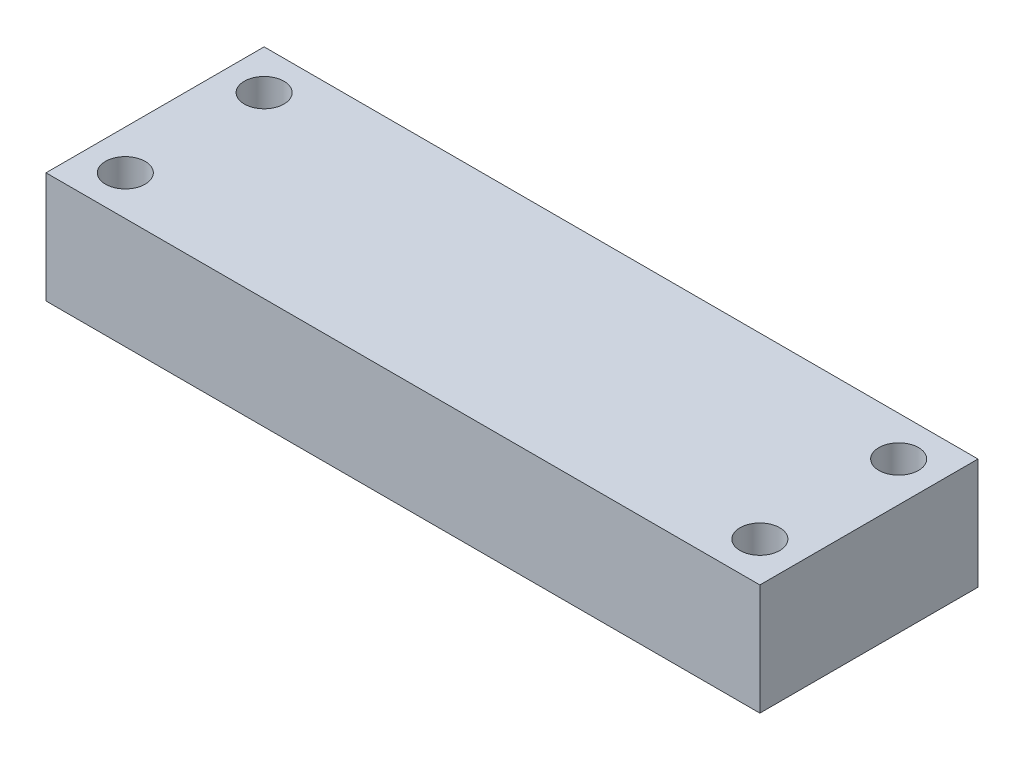
ISO-10303-21;
HEADER;
FILE_DESCRIPTION(('STEP AP214'),'2;1');
FILE_NAME('part.step','',(''),(''),'','','');
FILE_SCHEMA(('AUTOMOTIVE_DESIGN { 1 0 10303 214 1 1 1 1 }'));
ENDSEC;
DATA;
#1=APPLICATION_CONTEXT('core data for automotive mechanical design processes');
#2=APPLICATION_PROTOCOL_DEFINITION('international standard','automotive_design',2000,#1);
#3=PRODUCT_CONTEXT('',#1,'mechanical');
#4=PRODUCT('Part','Part','',(#3));
#5=PRODUCT_RELATED_PRODUCT_CATEGORY('part','',(#4));
#6=PRODUCT_DEFINITION_FORMATION('','',#4);
#7=PRODUCT_DEFINITION_CONTEXT('part definition',#1,'design');
#8=PRODUCT_DEFINITION('design','',#6,#7);
#9=PRODUCT_DEFINITION_SHAPE('','',#8);
#10=(LENGTH_UNIT() NAMED_UNIT(*) SI_UNIT(.MILLI.,.METRE.));
#11=(NAMED_UNIT(*) PLANE_ANGLE_UNIT() SI_UNIT($,.RADIAN.));
#12=(NAMED_UNIT(*) SI_UNIT($,.STERADIAN.) SOLID_ANGLE_UNIT());
#13=UNCERTAINTY_MEASURE_WITH_UNIT(LENGTH_MEASURE(1.E-05),#10,'distance_accuracy_value','');
#14=(GEOMETRIC_REPRESENTATION_CONTEXT(3) GLOBAL_UNCERTAINTY_ASSIGNED_CONTEXT((#13)) GLOBAL_UNIT_ASSIGNED_CONTEXT((#10,
#11,#12)) REPRESENTATION_CONTEXT('',''));
#15=CARTESIAN_POINT('',(0.,0.,0.));
#16=DIRECTION('',(0.,0.,1.));
#17=DIRECTION('',(1.,0.,0.));
#18=AXIS2_PLACEMENT_3D('',#15,#16,#17);
#19=CARTESIAN_POINT('',(0.,263.525,0.));
#20=DIRECTION('',(0.,1.,0.));
#21=DIRECTION('',(0.,0.,1.));
#22=AXIS2_PLACEMENT_3D('',#19,#20,#21);
#23=PLANE('',#22);
#24=CARTESIAN_POINT('',(70.0000000000001,263.525,10.));
#25=DIRECTION('',(0.,1.,0.));
#26=DIRECTION('',(0.,0.,1.));
#27=AXIS2_PLACEMENT_3D('',#24,#25,#26);
#28=CIRCLE('',#27,3.175);
#29=CARTESIAN_POINT('',(70.0000000000001,263.525,13.175));
#30=VERTEX_POINT('',#29);
#31=EDGE_CURVE('E38',#30,#30,#28,.T.);
#32=ORIENTED_EDGE('',*,*,#31,.T.);
#33=EDGE_LOOP('',(#32));
#34=FACE_BOUND('',#33,.T.);
#35=CARTESIAN_POINT('',(70.0000000000001,263.525,45.));
#36=DIRECTION('',(0.,1.,0.));
#37=DIRECTION('',(0.,0.,1.));
#38=AXIS2_PLACEMENT_3D('',#35,#36,#37);
#39=CIRCLE('',#38,3.175);
#40=CARTESIAN_POINT('',(70.0000000000001,263.525,48.175));
#41=VERTEX_POINT('',#40);
#42=EDGE_CURVE('E126',#41,#41,#39,.T.);
#43=ORIENTED_EDGE('',*,*,#42,.T.);
#44=EDGE_LOOP('',(#43));
#45=FACE_BOUND('',#44,.T.);
#46=CARTESIAN_POINT('',(230.,263.525,45.));
#47=DIRECTION('',(0.,1.,0.));
#48=DIRECTION('',(0.,0.,1.));
#49=AXIS2_PLACEMENT_3D('',#46,#47,#48);
#50=CIRCLE('',#49,3.175);
#51=CARTESIAN_POINT('',(230.,263.525,48.175));
#52=VERTEX_POINT('',#51);
#53=EDGE_CURVE('E123',#52,#52,#50,.T.);
#54=ORIENTED_EDGE('',*,*,#53,.T.);
#55=EDGE_LOOP('',(#54));
#56=FACE_BOUND('',#55,.T.);
#57=CARTESIAN_POINT('',(230.,263.525,9.99999999999999));
#58=DIRECTION('',(0.,1.,0.));
#59=DIRECTION('',(0.,0.,1.));
#60=AXIS2_PLACEMENT_3D('',#57,#58,#59);
#61=CIRCLE('',#60,3.175);
#62=CARTESIAN_POINT('',(230.,263.525,13.175));
#63=VERTEX_POINT('',#62);
#64=EDGE_CURVE('E120',#63,#63,#61,.T.);
#65=ORIENTED_EDGE('',*,*,#64,.T.);
#66=EDGE_LOOP('',(#65));
#67=FACE_BOUND('',#66,.T.);
#68=DIRECTION('',(1.,0.,0.));
#69=VECTOR('',#68,1.);
#70=CARTESIAN_POINT('',(241.253264434507,263.525,0.));
#71=LINE('',#70,#69);
#72=CARTESIAN_POINT('',(60.,263.525,0.));
#73=VERTEX_POINT('',#72);
#74=CARTESIAN_POINT('',(107.564012782426,263.525,0.));
#75=VERTEX_POINT('',#74);
#76=EDGE_CURVE('E110',#73,#75,#71,.T.);
#77=ORIENTED_EDGE('',*,*,#76,.T.);
#78=DIRECTION('',(0.,0.,1.));
#79=VECTOR('',#78,1.);
#80=CARTESIAN_POINT('',(107.564012782432,263.525,200.400182821008));
#81=LINE('',#80,#79);
#82=CARTESIAN_POINT('',(107.564012782429,263.525000000001,33.0000000025199));
#83=VERTEX_POINT('',#82);
#84=EDGE_CURVE('E50',#83,#75,#81,.F.);
#85=ORIENTED_EDGE('',*,*,#84,.F.);
#86=CARTESIAN_POINT('',(128.409183393374,263.525,37.2754741948868));
#87=CARTESIAN_POINT('',(128.051894710239,263.525,37.2836641761605));
#88=CARTESIAN_POINT('',(127.6945808691,263.525,37.2908580436216));
#89=CARTESIAN_POINT('',(126.979800252876,263.525,37.3029213767301));
#90=CARTESIAN_POINT('',(126.622333465375,263.525,37.3077900998672));
#91=CARTESIAN_POINT('',(125.907308636066,263.525,37.3148659469851));
#92=CARTESIAN_POINT('',(125.549750589352,263.525,37.3170725961095));
#93=CARTESIAN_POINT('',(124.834606252839,263.525,37.3184574758383));
#94=CARTESIAN_POINT('',(124.477019962629,263.525,37.3176355252875));
#95=CARTESIAN_POINT('',(123.760859504184,263.525,37.3125603889058));
#96=CARTESIAN_POINT('',(123.402285400806,263.525,37.3082975102587));
#97=CARTESIAN_POINT('',(122.685229894357,263.525,37.2958901570463));
#98=CARTESIAN_POINT('',(122.326748486316,263.525,37.2877459769455));
#99=CARTESIAN_POINT('',(121.60994018102,263.525,37.2670886446054));
#100=CARTESIAN_POINT('',(121.251613273173,263.525,37.2545758660324));
#101=CARTESIAN_POINT('',(120.53517713601,263.525,37.2246302296394));
#102=CARTESIAN_POINT('',(120.177067898286,263.525,37.2071975758378));
#103=CARTESIAN_POINT('',(119.472458511016,263.525,37.1674163274857));
#104=CARTESIAN_POINT('',(119.125948714547,263.525,37.1452402692858));
#105=CARTESIAN_POINT('',(118.433337233113,263.525,37.0950078689188));
#106=CARTESIAN_POINT('',(118.087235565238,263.525,37.0669512887018));
#107=CARTESIAN_POINT('',(117.39558596318,263.525,37.0041603520604));
#108=CARTESIAN_POINT('',(117.050038109821,263.525,36.9694250971018));
#109=CARTESIAN_POINT('',(116.359590004402,263.525,36.8922968555982));
#110=CARTESIAN_POINT('',(116.014690234281,263.525,36.8498995114988));
#111=CARTESIAN_POINT('',(115.326116320868,263.525,36.7562713772811));
#112=CARTESIAN_POINT('',(114.982442058973,263.525,36.7050414670269));
#113=CARTESIAN_POINT('',(114.296852999469,263.525,36.5922400283021));
#114=CARTESIAN_POINT('',(113.954937812492,263.525,36.5306708997104));
#115=CARTESIAN_POINT('',(113.342578387325,263.525,36.4088892849372));
#116=CARTESIAN_POINT('',(113.071688159953,263.525,36.350928985456));
#117=CARTESIAN_POINT('',(112.531986217608,263.525,36.2257654929522));
#118=CARTESIAN_POINT('',(112.263174825383,263.525,36.1585608939787));
#119=CARTESIAN_POINT('',(111.729479500192,263.525,36.0133604224585));
#120=CARTESIAN_POINT('',(111.464584999961,263.525,35.9354037755901));
#121=CARTESIAN_POINT('',(110.939177098807,263.525,35.7660655485733));
#122=CARTESIAN_POINT('',(110.678661894095,263.525,35.6746896545641));
#123=CARTESIAN_POINT('',(110.223056142982,263.525,35.4977009565297));
#124=CARTESIAN_POINT('',(110.026636970608,263.525,35.4155548510646));
#125=CARTESIAN_POINT('',(109.735818493693,263.525,35.2826000075541));
#126=CARTESIAN_POINT('',(109.639255498186,263.525,35.2365197732933));
#127=CARTESIAN_POINT('',(109.447949554132,263.525,35.1407358617284));
#128=CARTESIAN_POINT('',(109.35320641394,263.525,35.091032568634));
#129=CARTESIAN_POINT('',(109.138333573493,263.525,34.9722147119986));
#130=CARTESIAN_POINT('',(109.018968390922,263.525,34.9017020260968));
#131=CARTESIAN_POINT('',(108.785349757699,263.525,34.7522949595584));
#132=CARTESIAN_POINT('',(108.671101925771,263.525,34.6733916720582));
#133=CARTESIAN_POINT('',(108.450989762533,263.525,34.506097782546));
#134=CARTESIAN_POINT('',(108.345070978818,263.525,34.4177796013186));
#135=CARTESIAN_POINT('',(108.144622993734,263.525,34.2291331654217));
#136=CARTESIAN_POINT('',(108.050062419983,263.525,34.1288395928631));
#137=CARTESIAN_POINT('',(107.935041881477,263.525,33.9848109789745));
#138=CARTESIAN_POINT('',(107.906759946686,263.525,33.9472762981489));
#139=CARTESIAN_POINT('',(107.852620597751,263.525,33.8704851403311));
#140=CARTESIAN_POINT('',(107.826763127543,263.525,33.8312287031852));
#141=CARTESIAN_POINT('',(107.777981826993,263.525,33.7511543108066));
#142=CARTESIAN_POINT('',(107.755045988739,263.525,33.7103437059798));
#143=CARTESIAN_POINT('',(107.712426164581,263.525,33.6270452176555));
#144=CARTESIAN_POINT('',(107.692742285601,263.525,33.584557279064));
#145=CARTESIAN_POINT('',(107.657416466249,263.525,33.4987945123038));
#146=CARTESIAN_POINT('',(107.641709629132,263.525,33.4555465963542));
#147=CARTESIAN_POINT('',(107.61433987614,263.525,33.367798178957));
#148=CARTESIAN_POINT('',(107.602675383712,263.525,33.3232981731746));
#149=CARTESIAN_POINT('',(107.583625199713,263.525,33.2326422484606));
#150=CARTESIAN_POINT('',(107.576310440143,263.525,33.1864712531426));
#151=CARTESIAN_POINT('',(107.566483790554,263.525,33.093540588437));
#152=CARTESIAN_POINT('',(107.563980524835,263.525,33.0467800129328));
#153=CARTESIAN_POINT('',(107.564012782427,263.525,33.0000000025199));
#154=B_SPLINE_CURVE_WITH_KNOTS('',3,(#86,#87,#88,#89,#90,#91,#92,#93,#94,#95,#96,#97,#98,#99,
#100,#101,#102,#103,#104,#105,#106,#107,#108,#109,#110,#111,#112,#113,#114,#115,#116,#117,#118,
#119,#120,#121,#122,#123,#124,#125,#126,#127,#128,#129,#130,#131,#132,#133,#134,#135,#136,#137,
#138,#139,#140,#141,#142,#143,#144,#145,#146,#147,#148,#149,#150,#151,#152,#153),.UNSPECIFIED.,
.F.,.F.,(4,2,2,2,2,2,2,2,2,2,2,2,2,2,2,2,2,2,2,2,2,2,2,2,2,2,2,2,2,2,2,2,2,4),(0.,
1.07214969800926,2.14464154708534,3.21732467720169,4.29007197070426,5.36585169632604,
6.44154981826362,7.51715595332175,8.59271749148728,9.63432970381734,10.6759840898922,
11.7177787160515,12.7601677029906,13.802452911334,14.8444965240809,15.6754296450747,
16.5064892813857,17.3345935148826,18.1623478627303,18.8006703086957,19.1215899108674,
19.4424755302602,19.8581120492394,20.2741942678702,20.6872798417487,21.0991968367766,
21.2401141352356,21.3810281741905,21.5213429653124,21.6616623690712,21.799518187145,
21.9373201794314,22.0773117464936,22.2175540064837),.UNSPECIFIED.);
#155=CARTESIAN_POINT('',(128.409183393374,263.525,37.2754741948869));
#156=VERTEX_POINT('',#155);
#157=EDGE_CURVE('E57',#156,#83,#154,.T.);
#158=ORIENTED_EDGE('',*,*,#157,.F.);
#159=CARTESIAN_POINT('',(128.409183393375,263.525,37.2754741948869));
#160=CARTESIAN_POINT('',(128.935315344216,263.525,37.2634224363284));
#161=CARTESIAN_POINT('',(129.461491505504,263.525,37.2535435033356));
#162=CARTESIAN_POINT('',(130.513852839061,263.525,37.237426466283));
#163=CARTESIAN_POINT('',(131.040038006218,263.525,37.2311880332933));
#164=CARTESIAN_POINT('',(132.092412602007,263.525,37.2216454362855));
#165=CARTESIAN_POINT('',(132.61860202968,263.525,37.2183411582906));
#166=CARTESIAN_POINT('',(133.670985228738,263.525,37.2140483026083));
#167=CARTESIAN_POINT('',(134.19717900005,263.525,37.2130597054449));
#168=CARTESIAN_POINT('',(135.249572115499,263.525,37.2128345851069));
#169=CARTESIAN_POINT('',(135.775771459634,263.525,37.2135980813797));
#170=CARTESIAN_POINT('',(136.828173533466,263.525,37.2163711429077));
#171=CARTESIAN_POINT('',(137.354376263115,263.525,37.2183807248162));
#172=CARTESIAN_POINT('',(138.406783389086,263.525,37.2231925593134));
#173=CARTESIAN_POINT('',(138.932987785367,263.525,37.2259948201963));
#174=CARTESIAN_POINT('',(139.985396245271,263.525,37.2319931499325));
#175=CARTESIAN_POINT('',(140.511600308883,263.525,37.2351892202885));
#176=CARTESIAN_POINT('',(141.886491043867,263.525,37.2435928187358));
#177=CARTESIAN_POINT('',(142.735177525047,263.525,37.2488326767238));
#178=CARTESIAN_POINT('',(144.432556553816,263.525,37.2582425022373));
#179=CARTESIAN_POINT('',(145.281249101403,263.525,37.2624124701066));
#180=CARTESIAN_POINT('',(146.978632631595,263.525,37.2688930427409));
#181=CARTESIAN_POINT('',(147.827323614121,263.525,37.2712036674703));
#182=CARTESIAN_POINT('',(149.52470899831,263.525,37.2735609607826));
#183=CARTESIAN_POINT('',(150.373403399974,263.525,37.2736076291291));
#184=CARTESIAN_POINT('',(152.070797310421,263.525,37.271429254405));
#185=CARTESIAN_POINT('',(152.919496819173,263.525,37.2692041893922));
#186=CARTESIAN_POINT('',(154.616887765753,263.525,37.2628704112622));
#187=CARTESIAN_POINT('',(155.465579203586,263.525,37.2587616995014));
#188=CARTESIAN_POINT('',(157.162973220721,263.525,37.2494376641435));
#189=CARTESIAN_POINT('',(158.011675799885,263.525,37.2442223174891));
#190=CARTESIAN_POINT('',(159.709081238484,263.525,37.2338343237847));
#191=CARTESIAN_POINT('',(160.557784097918,263.525,37.228661676729));
#192=CARTESIAN_POINT('',(161.972290562856,263.525,37.2213439100927));
#193=CARTESIAN_POINT('',(162.538091764272,263.525,37.2187643559831));
#194=CARTESIAN_POINT('',(163.669696230646,263.525,37.2148419638552));
#195=CARTESIAN_POINT('',(164.235499495582,263.525,37.2134991201338));
#196=CARTESIAN_POINT('',(165.367101258372,263.525,37.2126551063442));
#197=CARTESIAN_POINT('',(165.9328997562,263.525,37.2131539137987));
#198=CARTESIAN_POINT('',(167.064516610619,263.525,37.2166755781878));
#199=CARTESIAN_POINT('',(167.630334966877,263.525,37.219698555104));
#200=CARTESIAN_POINT('',(168.761954151257,263.525,37.2290223167449));
#201=CARTESIAN_POINT('',(169.327754979074,263.525,37.2353231422159));
#202=CARTESIAN_POINT('',(170.459326126803,263.525,37.2520713840699));
#203=CARTESIAN_POINT('',(171.025096443194,263.525,37.2625190343745));
#204=CARTESIAN_POINT('',(171.590816606616,263.525,37.2754741948862));
#205=B_SPLINE_CURVE_WITH_KNOTS('',3,(#159,#160,#161,#162,#163,#164,#165,#166,#167,#168,#169,
#170,#171,#172,#173,#174,#175,#176,#177,#178,#179,#180,#181,#182,#183,#184,#185,#186,#187,#188,
#189,#190,#191,#192,#193,#194,#195,#196,#197,#198,#199,#200,#201,#202,#203,#204),.UNSPECIFIED.,
.F.,.F.,(4,2,2,2,2,2,2,2,2,2,2,2,2,2,2,2,2,2,2,2,2,2,4),(0.,1.57879740934248,3.1574521475984,
4.73604556052074,6.31462569662369,7.89322335427828,9.47184210937685,11.0504773829365,
12.6291186801294,15.1752265693772,17.7213336406751,20.2674133730744,22.8134933712835,
25.3595979617897,27.9057007187842,30.4518565303839,32.9980120064225,34.6954324514137,
36.3928450686892,38.0902369692669,39.7877095567272,41.4852032456054,43.1827927034092),.UNSPECIFIED.);
#206=CARTESIAN_POINT('',(171.590816606617,263.525,37.2754741948862));
#207=VERTEX_POINT('',#206);
#208=EDGE_CURVE('E43',#156,#207,#205,.T.);
#209=ORIENTED_EDGE('',*,*,#208,.T.);
#210=CARTESIAN_POINT('',(192.435987217564,263.525,33.0000000025184));
#211=CARTESIAN_POINT('',(192.436011088802,263.525,33.0434393153706));
#212=CARTESIAN_POINT('',(192.433856176102,263.525,33.08686429808));
#213=CARTESIAN_POINT('',(192.425375267438,263.525,33.1732424197555));
#214=CARTESIAN_POINT('',(192.419055448113,263.525,33.2161961618266));
#215=CARTESIAN_POINT('',(192.402545183961,263.525,33.3007307171293));
#216=CARTESIAN_POINT('',(192.392409485246,263.525,33.3423223025522));
#217=CARTESIAN_POINT('',(192.368567292052,263.525,33.4244716410908));
#218=CARTESIAN_POINT('',(192.354859356591,263.525,33.4650289697393));
#219=CARTESIAN_POINT('',(192.301511476489,263.525,33.6040140451591));
#220=CARTESIAN_POINT('',(192.253507947504,263.525,33.6992960167715));
#221=CARTESIAN_POINT('',(192.142841416342,263.525,33.8812901528896));
#222=CARTESIAN_POINT('',(192.080093419695,263.525,33.9679483186598));
#223=CARTESIAN_POINT('',(191.954284243189,263.525,34.1207884449622));
#224=CARTESIAN_POINT('',(191.892588833982,263.525,34.1881171948751));
#225=CARTESIAN_POINT('',(191.76361436149,263.525,34.3172409887717));
#226=CARTESIAN_POINT('',(191.69633098353,263.525,34.3790316786258));
#227=CARTESIAN_POINT('',(191.557507292685,263.525,34.4977629716423));
#228=CARTESIAN_POINT('',(191.485961852969,263.525,34.5546975247703));
#229=CARTESIAN_POINT('',(191.339676363574,263.525,34.6642181857243));
#230=CARTESIAN_POINT('',(191.264937266281,263.525,34.7168055763861));
#231=CARTESIAN_POINT('',(191.044517053055,263.525,34.8638515831894));
#232=CARTESIAN_POINT('',(190.895546915487,263.525,34.953381809466));
#233=CARTESIAN_POINT('',(190.591465649165,263.525,35.121723090095));
#234=CARTESIAN_POINT('',(190.436344420284,263.525,35.200515485043));
#235=CARTESIAN_POINT('',(190.121817517514,263.525,35.3493041042936));
#236=CARTESIAN_POINT('',(189.962408495746,263.525,35.4192931978977));
#237=CARTESIAN_POINT('',(189.639705637532,263.525,35.5522455571298));
#238=CARTESIAN_POINT('',(189.476395446229,263.525,35.6151687515782));
#239=CARTESIAN_POINT('',(189.147667328852,263.525,35.7346221830566));
#240=CARTESIAN_POINT('',(188.9822518683,263.525,35.7911592477392));
#241=CARTESIAN_POINT('',(188.649731164323,263.525,35.8987655906204));
#242=CARTESIAN_POINT('',(188.482626571709,263.525,35.9498368929843));
#243=CARTESIAN_POINT('',(188.090578275526,263.525,36.0636119881741));
#244=CARTESIAN_POINT('',(187.865093092547,263.525,36.1244472986276));
#245=CARTESIAN_POINT('',(187.412286167399,263.525,36.2389021600035));
#246=CARTESIAN_POINT('',(187.184964195884,263.525,36.2925207946019));
#247=CARTESIAN_POINT('',(186.728637477402,263.525,36.3935729941319));
#248=CARTESIAN_POINT('',(186.49963088723,263.525,36.4409981956179));
#249=CARTESIAN_POINT('',(186.040542547323,263.525,36.5303478237254));
#250=CARTESIAN_POINT('',(185.810460738945,263.525,36.5722719465985));
#251=CARTESIAN_POINT('',(185.118289882874,263.525,36.6908713714814));
#252=CARTESIAN_POINT('',(184.654941060859,263.525,36.760230551034));
#253=CARTESIAN_POINT('',(183.726117370076,263.525,36.8832723715313));
#254=CARTESIAN_POINT('',(183.260642037482,263.525,36.9369514085709));
#255=CARTESIAN_POINT('',(182.327633321121,263.525,37.031398365197));
#256=CARTESIAN_POINT('',(181.860097819882,263.525,37.0721451074196));
#257=CARTESIAN_POINT('',(180.92477699676,263.525,37.1426513582292));
#258=CARTESIAN_POINT('',(180.456992640789,263.525,37.1724239361714));
#259=CARTESIAN_POINT('',(179.521177447414,263.525,37.222679734808));
#260=CARTESIAN_POINT('',(179.053146862595,263.525,37.2431677516688));
#261=CARTESIAN_POINT('',(178.11682870838,263.525,37.276222912991));
#262=CARTESIAN_POINT('',(177.648541148668,263.525,37.2887903378332));
#263=CARTESIAN_POINT('',(176.868720646019,263.525,37.3040646799131));
#264=CARTESIAN_POINT('',(176.55722232422,263.525,37.3086644314647));
#265=CARTESIAN_POINT('',(175.934144765646,263.525,37.3151557165912));
#266=CARTESIAN_POINT('',(175.6225655241,263.525,37.3170467915974));
#267=CARTESIAN_POINT('',(174.9993723003,263.525,37.3183916086863));
#268=CARTESIAN_POINT('',(174.68775831762,263.525,37.3178451131127));
#269=CARTESIAN_POINT('',(174.066591723463,263.525,37.3145762343992));
#270=CARTESIAN_POINT('',(173.7570390334,263.525,37.3118681852725));
#271=CARTESIAN_POINT('',(173.137988594077,263.525,37.3045255586765));
#272=CARTESIAN_POINT('',(172.82849084243,263.525,37.2998911770294));
#273=CARTESIAN_POINT('',(172.209594792562,263.525,37.2889117740157));
#274=CARTESIAN_POINT('',(171.900196487588,263.525,37.2825671358309));
#275=CARTESIAN_POINT('',(171.590816606617,263.525,37.2754741948861));
#276=B_SPLINE_CURVE_WITH_KNOTS('',3,(#210,#211,#212,#213,#214,#215,#216,#217,#218,#219,#220,
#221,#222,#223,#224,#225,#226,#227,#228,#229,#230,#231,#232,#233,#234,#235,#236,#237,#238,#239,
#240,#241,#242,#243,#244,#245,#246,#247,#248,#249,#250,#251,#252,#253,#254,#255,#256,#257,#258,
#259,#260,#261,#262,#263,#264,#265,#266,#267,#268,#269,#270,#271,#272,#273,#274,#275),
.UNSPECIFIED.,.F.,.F.,(4,2,2,2,2,2,2,2,2,2,2,2,2,2,2,2,2,2,2,2,2,2,2,2,2,2,2,2,2,2,2,2,4),(0.,
0.130241429364157,0.260290141443698,0.388540068376575,0.516841809550153,0.834941817756816,
1.15492255672254,1.42848738000307,1.70226543229465,1.97637973595619,2.25041285831362,
2.77116249270016,3.29280581231198,3.81486898006165,4.33975738168852,4.86407918468506,
5.38820613589385,6.08869943050761,6.78928158522914,7.4908002146554,8.19235756294127,
9.5975130980863,11.0029913388343,12.4107593945532,13.8168454520471,15.2222043311899,
16.6275134592834,17.5620991178346,18.4968429794914,19.431677977976,20.3603647546448,
21.2889571482922,22.2173416641275),.UNSPECIFIED.);
#277=CARTESIAN_POINT('',(192.435987217562,263.525000000001,33.0000000025184));
#278=VERTEX_POINT('',#277);
#279=EDGE_CURVE('E100',#278,#207,#276,.T.);
#280=ORIENTED_EDGE('',*,*,#279,.F.);
#281=DIRECTION('',(0.,0.,1.));
#282=VECTOR('',#281,1.);
#283=CARTESIAN_POINT('',(192.435987217565,263.525,200.400182821006));
#284=LINE('',#283,#282);
#285=CARTESIAN_POINT('',(192.435987217564,263.525,0.));
#286=VERTEX_POINT('',#285);
#287=EDGE_CURVE('E94',#286,#278,#284,.T.);
#288=ORIENTED_EDGE('',*,*,#287,.F.);
#289=CARTESIAN_POINT('',(240.,263.525,0.));
#290=VERTEX_POINT('',#289);
#291=EDGE_CURVE('E98',#286,#290,#71,.T.);
#292=ORIENTED_EDGE('',*,*,#291,.T.);
#293=DIRECTION('',(0.,0.,-1.));
#294=VECTOR('',#293,1.);
#295=CARTESIAN_POINT('',(240.,263.525,0.));
#296=LINE('',#295,#294);
#297=CARTESIAN_POINT('',(240.,263.525,54.9999999999999));
#298=VERTEX_POINT('',#297);
#299=EDGE_CURVE('E266',#298,#290,#296,.T.);
#300=ORIENTED_EDGE('',*,*,#299,.F.);
#301=DIRECTION('',(1.,0.,0.));
#302=VECTOR('',#301,1.);
#303=CARTESIAN_POINT('',(240.,263.525,54.9999999999999));
#304=LINE('',#303,#302);
#305=CARTESIAN_POINT('',(60.0000000000001,263.525,55.));
#306=VERTEX_POINT('',#305);
#307=EDGE_CURVE('E264',#306,#298,#304,.T.);
#308=ORIENTED_EDGE('',*,*,#307,.F.);
#309=DIRECTION('',(0.,0.,1.));
#310=VECTOR('',#309,1.);
#311=CARTESIAN_POINT('',(60.0000000000001,263.525,55.));
#312=LINE('',#311,#310);
#313=EDGE_CURVE('E295',#73,#306,#312,.T.);
#314=ORIENTED_EDGE('',*,*,#313,.F.);
#315=EDGE_LOOP('',(#77,#85,#158,#209,#280,#288,#292,#300,#308,#314));
#316=FACE_BOUND('',#315,.T.);
#317=ADVANCED_FACE('F34',(#34,#45,#56,#67,#316),#23,.F.);
#318=CARTESIAN_POINT('',(283.519735499998,131.762500000001,37.2754741948838));
#319=CARTESIAN_POINT('',(278.834697888002,131.762500000001,36.6110517302186));
#320=CARTESIAN_POINT('',(276.302452499998,131.762500000001,40.0406980173928));
#321=CARTESIAN_POINT('',(276.302452499998,131.762500000001,43.5629362424831));
#322=(BOUNDED_CURVE() B_SPLINE_CURVE(3,(#318,#319,#320,#321),.UNSPECIFIED.,.F.,
.F.) B_SPLINE_CURVE_WITH_KNOTS((4,4),(0.,1.),
.UNSPECIFIED.) CURVE() GEOMETRIC_REPRESENTATION_ITEM() RATIONAL_B_SPLINE_CURVE((0.255591691964593,
0.242825015050018,0.327183181081988,0.508666190060503)) REPRESENTATION_ITEM(''));
#323=CARTESIAN_POINT('',(149.999999999999,131.7625,200.400182821007));
#324=DIRECTION('',(0.,0.,1.));
#325=AXIS1_PLACEMENT('',#323,#324);
#326=SURFACE_OF_REVOLUTION('',#322,#325);
#327=ORIENTED_EDGE('',*,*,#208,.F.);
#328=CARTESIAN_POINT('',(149.999999999996,131.762500000001,37.2754741948861));
#329=DIRECTION('',(0.,0.,1.));
#330=DIRECTION('',(1.,0.,0.));
#331=AXIS2_PLACEMENT_3D('',#328,#329,#330);
#332=CIRCLE('',#331,133.519735500002);
#333=EDGE_CURVE('E286',#207,#156,#332,.T.);
#334=ORIENTED_EDGE('',*,*,#333,.F.);
#335=EDGE_LOOP('',(#327,#334));
#336=FACE_BOUND('',#335,.T.);
#337=ADVANCED_FACE('F163',(#336),#326,.F.);
#338=CARTESIAN_POINT('',(283.519735499998,131.762500000001,37.2754741948837));
#339=CARTESIAN_POINT('',(286.705561076155,131.762500000001,37.7272814708559));
#340=CARTESIAN_POINT('',(288.427487939998,131.762500000001,35.3951219955774));
#341=CARTESIAN_POINT('',(288.427487939998,131.762500000001,33.0000000025163));
#342=(BOUNDED_CURVE() B_SPLINE_CURVE(3,(#338,#339,#340,#341),.UNSPECIFIED.,.F.,
.F.) B_SPLINE_CURVE_WITH_KNOTS((4,4),(0.,1.),
.UNSPECIFIED.) CURVE() GEOMETRIC_REPRESENTATION_ITEM() RATIONAL_B_SPLINE_CURVE((0.255591691964592,
0.242825015050017,0.327183181081988,0.508666190060503)) REPRESENTATION_ITEM(''));
#343=CARTESIAN_POINT('',(149.999999999999,131.7625,200.400182821007));
#344=DIRECTION('',(0.,0.,1.));
#345=AXIS1_PLACEMENT('',#343,#344);
#346=SURFACE_OF_REVOLUTION('',#342,#345);
#347=CARTESIAN_POINT('',(149.999999999996,131.762500000001,33.0000000025187));
#348=DIRECTION('',(0.,0.,1.));
#349=DIRECTION('',(1.,0.,0.));
#350=AXIS2_PLACEMENT_3D('',#347,#348,#349);
#351=CIRCLE('',#350,138.427487940002);
#352=EDGE_CURVE('E147',#278,#83,#351,.T.);
#353=ORIENTED_EDGE('',*,*,#352,.F.);
#354=ORIENTED_EDGE('',*,*,#279,.T.);
#355=ORIENTED_EDGE('',*,*,#333,.T.);
#356=ORIENTED_EDGE('',*,*,#157,.T.);
#357=EDGE_LOOP('',(#353,#354,#355,#356));
#358=FACE_BOUND('',#357,.T.);
#359=ADVANCED_FACE('F168',(#358),#346,.T.);
#360=CARTESIAN_POINT('',(149.999999999999,131.7625,200.400182821007));
#361=DIRECTION('',(0.,0.,1.));
#362=DIRECTION('',(1.,0.,0.));
#363=AXIS2_PLACEMENT_3D('',#360,#361,#362);
#364=CYLINDRICAL_SURFACE('',#363,138.427487940002);
#365=ORIENTED_EDGE('',*,*,#352,.T.);
#366=ORIENTED_EDGE('',*,*,#84,.T.);
#367=CARTESIAN_POINT('',(149.999999999995,131.762500000001,0.));
#368=DIRECTION('',(0.,0.,-1.));
#369=DIRECTION('',(-1.,0.,0.));
#370=AXIS2_PLACEMENT_3D('',#367,#368,#369);
#371=CIRCLE('',#370,138.427487940002);
#372=EDGE_CURVE('E11',#75,#286,#371,.T.);
#373=ORIENTED_EDGE('',*,*,#372,.T.);
#374=ORIENTED_EDGE('',*,*,#287,.T.);
#375=EDGE_LOOP('',(#365,#366,#373,#374));
#376=FACE_BOUND('',#375,.T.);
#377=ADVANCED_FACE('F104',(#376),#364,.F.);
#378=CARTESIAN_POINT('',(241.253264434507,233.525,0.));
#379=DIRECTION('',(0.,0.,-1.));
#380=DIRECTION('',(-1.,0.,0.));
#381=AXIS2_PLACEMENT_3D('',#378,#379,#380);
#382=PLANE('',#381);
#383=ORIENTED_EDGE('',*,*,#372,.F.);
#384=ORIENTED_EDGE('',*,*,#76,.F.);
#385=DIRECTION('',(0.,-1.,0.));
#386=VECTOR('',#385,1.);
#387=CARTESIAN_POINT('',(60.,291.525,0.));
#388=LINE('',#387,#386);
#389=CARTESIAN_POINT('',(60.,291.525,0.));
#390=VERTEX_POINT('',#389);
#391=EDGE_CURVE('E267',#390,#73,#388,.T.);
#392=ORIENTED_EDGE('',*,*,#391,.F.);
#393=DIRECTION('',(-1.,0.,0.));
#394=VECTOR('',#393,1.);
#395=CARTESIAN_POINT('',(60.,291.525,0.));
#396=LINE('',#395,#394);
#397=CARTESIAN_POINT('',(240.,291.525,0.));
#398=VERTEX_POINT('',#397);
#399=EDGE_CURVE('E258',#398,#390,#396,.T.);
#400=ORIENTED_EDGE('',*,*,#399,.F.);
#401=DIRECTION('',(0.,-1.,0.));
#402=VECTOR('',#401,1.);
#403=CARTESIAN_POINT('',(240.,291.525,0.));
#404=LINE('',#403,#402);
#405=EDGE_CURVE('E102',#398,#290,#404,.T.);
#406=ORIENTED_EDGE('',*,*,#405,.T.);
#407=ORIENTED_EDGE('',*,*,#291,.F.);
#408=EDGE_LOOP('',(#383,#384,#392,#400,#406,#407));
#409=FACE_BOUND('',#408,.T.);
#410=ADVANCED_FACE('F108',(#409),#382,.T.);
#411=CARTESIAN_POINT('',(60.0000000000001,291.525,55.));
#412=DIRECTION('',(1.,0.,0.));
#413=DIRECTION('',(0.,0.,-1.));
#414=AXIS2_PLACEMENT_3D('',#411,#412,#413);
#415=PLANE('',#414);
#416=ORIENTED_EDGE('',*,*,#313,.T.);
#417=DIRECTION('',(0.,-1.,0.));
#418=VECTOR('',#417,1.);
#419=CARTESIAN_POINT('',(60.0000000000001,291.525,55.));
#420=LINE('',#419,#418);
#421=CARTESIAN_POINT('',(60.0000000000001,291.525,55.));
#422=VERTEX_POINT('',#421);
#423=EDGE_CURVE('E270',#422,#306,#420,.T.);
#424=ORIENTED_EDGE('',*,*,#423,.F.);
#425=DIRECTION('',(0.,0.,1.));
#426=VECTOR('',#425,1.);
#427=CARTESIAN_POINT('',(60.0000000000001,291.525,55.));
#428=LINE('',#427,#426);
#429=EDGE_CURVE('E290',#390,#422,#428,.T.);
#430=ORIENTED_EDGE('',*,*,#429,.F.);
#431=ORIENTED_EDGE('',*,*,#391,.T.);
#432=EDGE_LOOP('',(#416,#424,#430,#431));
#433=FACE_BOUND('',#432,.T.);
#434=ADVANCED_FACE('F177',(#433),#415,.F.);
#435=CARTESIAN_POINT('',(0.,291.525,0.));
#436=DIRECTION('',(0.,-1.,0.));
#437=DIRECTION('',(0.,0.,-1.));
#438=AXIS2_PLACEMENT_3D('',#435,#436,#437);
#439=PLANE('',#438);
#440=CARTESIAN_POINT('',(230.,291.525,45.));
#441=DIRECTION('',(0.,1.,0.));
#442=DIRECTION('',(0.,0.,1.));
#443=AXIS2_PLACEMENT_3D('',#440,#441,#442);
#444=CIRCLE('',#443,4.99999999999999);
#445=CARTESIAN_POINT('',(230.,291.525,50.));
#446=VERTEX_POINT('',#445);
#447=EDGE_CURVE('E131',#446,#446,#444,.T.);
#448=ORIENTED_EDGE('',*,*,#447,.F.);
#449=EDGE_LOOP('',(#448));
#450=FACE_BOUND('',#449,.T.);
#451=CARTESIAN_POINT('',(230.,291.525,9.99999999999999));
#452=DIRECTION('',(0.,1.,0.));
#453=DIRECTION('',(0.,0.,1.));
#454=AXIS2_PLACEMENT_3D('',#451,#452,#453);
#455=CIRCLE('',#454,4.99999999999999);
#456=CARTESIAN_POINT('',(230.,291.525,15.));
#457=VERTEX_POINT('',#456);
#458=EDGE_CURVE('E140',#457,#457,#455,.T.);
#459=ORIENTED_EDGE('',*,*,#458,.F.);
#460=EDGE_LOOP('',(#459));
#461=FACE_BOUND('',#460,.T.);
#462=CARTESIAN_POINT('',(70.0000000000001,291.525,10.));
#463=DIRECTION('',(0.,1.,0.));
#464=DIRECTION('',(0.,0.,1.));
#465=AXIS2_PLACEMENT_3D('',#462,#463,#464);
#466=CIRCLE('',#465,5.);
#467=CARTESIAN_POINT('',(70.0000000000001,291.525,15.));
#468=VERTEX_POINT('',#467);
#469=EDGE_CURVE('E405',#468,#468,#466,.T.);
#470=ORIENTED_EDGE('',*,*,#469,.F.);
#471=EDGE_LOOP('',(#470));
#472=FACE_BOUND('',#471,.T.);
#473=CARTESIAN_POINT('',(70.0000000000001,291.525,45.));
#474=DIRECTION('',(0.,1.,0.));
#475=DIRECTION('',(0.,0.,1.));
#476=AXIS2_PLACEMENT_3D('',#473,#474,#475);
#477=CIRCLE('',#476,5.00000000000001);
#478=CARTESIAN_POINT('',(70.0000000000001,291.525,50.));
#479=VERTEX_POINT('',#478);
#480=EDGE_CURVE('E148',#479,#479,#477,.T.);
#481=ORIENTED_EDGE('',*,*,#480,.F.);
#482=EDGE_LOOP('',(#481));
#483=FACE_BOUND('',#482,.T.);
#484=DIRECTION('',(0.,0.,-1.));
#485=VECTOR('',#484,1.);
#486=CARTESIAN_POINT('',(240.,291.525,0.));
#487=LINE('',#486,#485);
#488=CARTESIAN_POINT('',(240.,291.525,54.9999999999999));
#489=VERTEX_POINT('',#488);
#490=EDGE_CURVE('E257',#489,#398,#487,.T.);
#491=ORIENTED_EDGE('',*,*,#490,.T.);
#492=ORIENTED_EDGE('',*,*,#399,.T.);
#493=ORIENTED_EDGE('',*,*,#429,.T.);
#494=DIRECTION('',(1.,0.,0.));
#495=VECTOR('',#494,1.);
#496=CARTESIAN_POINT('',(240.,291.525,54.9999999999999));
#497=LINE('',#496,#495);
#498=EDGE_CURVE('E261',#422,#489,#497,.T.);
#499=ORIENTED_EDGE('',*,*,#498,.T.);
#500=EDGE_LOOP('',(#491,#492,#493,#499));
#501=FACE_BOUND('',#500,.T.);
#502=ADVANCED_FACE('F173',(#450,#461,#472,#483,#501),#439,.F.);
#503=CARTESIAN_POINT('',(240.,291.525,0.));
#504=DIRECTION('',(-1.,0.,0.));
#505=DIRECTION('',(0.,0.,1.));
#506=AXIS2_PLACEMENT_3D('',#503,#504,#505);
#507=PLANE('',#506);
#508=ORIENTED_EDGE('',*,*,#299,.T.);
#509=ORIENTED_EDGE('',*,*,#405,.F.);
#510=ORIENTED_EDGE('',*,*,#490,.F.);
#511=DIRECTION('',(0.,-1.,0.));
#512=VECTOR('',#511,1.);
#513=CARTESIAN_POINT('',(240.,291.525,54.9999999999999));
#514=LINE('',#513,#512);
#515=EDGE_CURVE('E293',#489,#298,#514,.T.);
#516=ORIENTED_EDGE('',*,*,#515,.T.);
#517=EDGE_LOOP('',(#508,#509,#510,#516));
#518=FACE_BOUND('',#517,.T.);
#519=ADVANCED_FACE('F176',(#518),#507,.F.);
#520=CARTESIAN_POINT('',(240.,291.525,54.9999999999999));
#521=DIRECTION('',(0.,0.,-1.));
#522=DIRECTION('',(-1.,0.,0.));
#523=AXIS2_PLACEMENT_3D('',#520,#521,#522);
#524=PLANE('',#523);
#525=ORIENTED_EDGE('',*,*,#307,.T.);
#526=ORIENTED_EDGE('',*,*,#515,.F.);
#527=ORIENTED_EDGE('',*,*,#498,.F.);
#528=ORIENTED_EDGE('',*,*,#423,.T.);
#529=EDGE_LOOP('',(#525,#526,#527,#528));
#530=FACE_BOUND('',#529,.T.);
#531=ADVANCED_FACE('F179',(#530),#524,.F.);
#532=CARTESIAN_POINT('',(70.0000000000001,281.525,45.));
#533=DIRECTION('',(0.,1.,0.));
#534=DIRECTION('',(0.,0.,1.));
#535=AXIS2_PLACEMENT_3D('',#532,#533,#534);
#536=CYLINDRICAL_SURFACE('',#535,5.00000000000001);
#537=CARTESIAN_POINT('',(70.0000000000001,281.525,45.));
#538=DIRECTION('',(0.,1.,0.));
#539=DIRECTION('',(0.,0.,1.));
#540=AXIS2_PLACEMENT_3D('',#537,#538,#539);
#541=CIRCLE('',#540,5.00000000000001);
#542=CARTESIAN_POINT('',(70.0000000000001,281.525,50.));
#543=VERTEX_POINT('',#542);
#544=EDGE_CURVE('E144',#543,#543,#541,.T.);
#545=ORIENTED_EDGE('',*,*,#544,.F.);
#546=EDGE_LOOP('',(#545));
#547=FACE_BOUND('',#546,.T.);
#548=ORIENTED_EDGE('',*,*,#480,.T.);
#549=EDGE_LOOP('',(#548));
#550=FACE_BOUND('',#549,.T.);
#551=ADVANCED_FACE('F170',(#547,#550),#536,.F.);
#552=CARTESIAN_POINT('',(70.0000000000001,281.525,45.));
#553=DIRECTION('',(0.,1.,0.));
#554=DIRECTION('',(0.,0.,1.));
#555=AXIS2_PLACEMENT_3D('',#552,#553,#554);
#556=PLANE('',#555);
#557=CARTESIAN_POINT('',(70.0000000000001,281.525,45.));
#558=DIRECTION('',(0.,1.,0.));
#559=DIRECTION('',(0.,0.,1.));
#560=AXIS2_PLACEMENT_3D('',#557,#558,#559);
#561=CIRCLE('',#560,3.175);
#562=CARTESIAN_POINT('',(70.0000000000001,281.525,48.175));
#563=VERTEX_POINT('',#562);
#564=EDGE_CURVE('E395',#563,#563,#561,.T.);
#565=ORIENTED_EDGE('',*,*,#564,.F.);
#566=EDGE_LOOP('',(#565));
#567=FACE_BOUND('',#566,.T.);
#568=ORIENTED_EDGE('',*,*,#544,.T.);
#569=EDGE_LOOP('',(#568));
#570=FACE_BOUND('',#569,.T.);
#571=ADVANCED_FACE('F231',(#567,#570),#556,.T.);
#572=CARTESIAN_POINT('',(70.0000000000001,281.525,10.));
#573=DIRECTION('',(0.,1.,0.));
#574=DIRECTION('',(0.,0.,1.));
#575=AXIS2_PLACEMENT_3D('',#572,#573,#574);
#576=CYLINDRICAL_SURFACE('',#575,5.);
#577=CARTESIAN_POINT('',(70.0000000000001,281.525,10.));
#578=DIRECTION('',(0.,1.,0.));
#579=DIRECTION('',(0.,0.,1.));
#580=AXIS2_PLACEMENT_3D('',#577,#578,#579);
#581=CIRCLE('',#580,5.);
#582=CARTESIAN_POINT('',(70.0000000000001,281.525,15.));
#583=VERTEX_POINT('',#582);
#584=EDGE_CURVE('E151',#583,#583,#581,.T.);
#585=ORIENTED_EDGE('',*,*,#584,.F.);
#586=EDGE_LOOP('',(#585));
#587=FACE_BOUND('',#586,.T.);
#588=ORIENTED_EDGE('',*,*,#469,.T.);
#589=EDGE_LOOP('',(#588));
#590=FACE_BOUND('',#589,.T.);
#591=ADVANCED_FACE('F227',(#587,#590),#576,.F.);
#592=CARTESIAN_POINT('',(70.0000000000001,281.525,10.));
#593=DIRECTION('',(0.,1.,0.));
#594=DIRECTION('',(0.,0.,1.));
#595=AXIS2_PLACEMENT_3D('',#592,#593,#594);
#596=PLANE('',#595);
#597=CARTESIAN_POINT('',(70.0000000000001,281.525,10.));
#598=DIRECTION('',(0.,1.,0.));
#599=DIRECTION('',(0.,0.,1.));
#600=AXIS2_PLACEMENT_3D('',#597,#598,#599);
#601=CIRCLE('',#600,3.175);
#602=CARTESIAN_POINT('',(70.0000000000001,281.525,13.175));
#603=VERTEX_POINT('',#602);
#604=EDGE_CURVE('E394',#603,#603,#601,.T.);
#605=ORIENTED_EDGE('',*,*,#604,.F.);
#606=EDGE_LOOP('',(#605));
#607=FACE_BOUND('',#606,.T.);
#608=ORIENTED_EDGE('',*,*,#584,.T.);
#609=EDGE_LOOP('',(#608));
#610=FACE_BOUND('',#609,.T.);
#611=ADVANCED_FACE('F223',(#607,#610),#596,.T.);
#612=CARTESIAN_POINT('',(230.,281.525,9.99999999999999));
#613=DIRECTION('',(0.,1.,0.));
#614=DIRECTION('',(0.,0.,1.));
#615=AXIS2_PLACEMENT_3D('',#612,#613,#614);
#616=CYLINDRICAL_SURFACE('',#615,4.99999999999999);
#617=CARTESIAN_POINT('',(230.,281.525,9.99999999999999));
#618=DIRECTION('',(0.,1.,0.));
#619=DIRECTION('',(0.,0.,1.));
#620=AXIS2_PLACEMENT_3D('',#617,#618,#619);
#621=CIRCLE('',#620,4.99999999999999);
#622=CARTESIAN_POINT('',(230.,281.525,15.));
#623=VERTEX_POINT('',#622);
#624=EDGE_CURVE('E408',#623,#623,#621,.T.);
#625=ORIENTED_EDGE('',*,*,#624,.F.);
#626=EDGE_LOOP('',(#625));
#627=FACE_BOUND('',#626,.T.);
#628=ORIENTED_EDGE('',*,*,#458,.T.);
#629=EDGE_LOOP('',(#628));
#630=FACE_BOUND('',#629,.T.);
#631=ADVANCED_FACE('F226',(#627,#630),#616,.F.);
#632=CARTESIAN_POINT('',(230.,281.525,9.99999999999999));
#633=DIRECTION('',(0.,1.,0.));
#634=DIRECTION('',(0.,0.,1.));
#635=AXIS2_PLACEMENT_3D('',#632,#633,#634);
#636=PLANE('',#635);
#637=CARTESIAN_POINT('',(230.,281.525,9.99999999999999));
#638=DIRECTION('',(0.,1.,0.));
#639=DIRECTION('',(0.,0.,1.));
#640=AXIS2_PLACEMENT_3D('',#637,#638,#639);
#641=CIRCLE('',#640,3.175);
#642=CARTESIAN_POINT('',(230.,281.525,13.175));
#643=VERTEX_POINT('',#642);
#644=EDGE_CURVE('E124',#643,#643,#641,.T.);
#645=ORIENTED_EDGE('',*,*,#644,.F.);
#646=EDGE_LOOP('',(#645));
#647=FACE_BOUND('',#646,.T.);
#648=ORIENTED_EDGE('',*,*,#624,.T.);
#649=EDGE_LOOP('',(#648));
#650=FACE_BOUND('',#649,.T.);
#651=ADVANCED_FACE('F233',(#647,#650),#636,.T.);
#652=CARTESIAN_POINT('',(230.,281.525,45.));
#653=DIRECTION('',(0.,1.,0.));
#654=DIRECTION('',(0.,0.,1.));
#655=AXIS2_PLACEMENT_3D('',#652,#653,#654);
#656=CYLINDRICAL_SURFACE('',#655,4.99999999999999);
#657=CARTESIAN_POINT('',(230.,281.525,45.));
#658=DIRECTION('',(0.,1.,0.));
#659=DIRECTION('',(0.,0.,1.));
#660=AXIS2_PLACEMENT_3D('',#657,#658,#659);
#661=CIRCLE('',#660,4.99999999999999);
#662=CARTESIAN_POINT('',(230.,281.525,50.));
#663=VERTEX_POINT('',#662);
#664=EDGE_CURVE('E135',#663,#663,#661,.T.);
#665=ORIENTED_EDGE('',*,*,#664,.F.);
#666=EDGE_LOOP('',(#665));
#667=FACE_BOUND('',#666,.T.);
#668=ORIENTED_EDGE('',*,*,#447,.T.);
#669=EDGE_LOOP('',(#668));
#670=FACE_BOUND('',#669,.T.);
#671=ADVANCED_FACE('F215',(#667,#670),#656,.F.);
#672=CARTESIAN_POINT('',(230.,281.525,45.));
#673=DIRECTION('',(0.,1.,0.));
#674=DIRECTION('',(0.,0.,1.));
#675=AXIS2_PLACEMENT_3D('',#672,#673,#674);
#676=PLANE('',#675);
#677=CARTESIAN_POINT('',(230.,281.525,45.));
#678=DIRECTION('',(0.,1.,0.));
#679=DIRECTION('',(0.,0.,1.));
#680=AXIS2_PLACEMENT_3D('',#677,#678,#679);
#681=CIRCLE('',#680,3.175);
#682=CARTESIAN_POINT('',(230.,281.525,48.175));
#683=VERTEX_POINT('',#682);
#684=EDGE_CURVE('E398',#683,#683,#681,.T.);
#685=ORIENTED_EDGE('',*,*,#684,.F.);
#686=EDGE_LOOP('',(#685));
#687=FACE_BOUND('',#686,.T.);
#688=ORIENTED_EDGE('',*,*,#664,.T.);
#689=EDGE_LOOP('',(#688));
#690=FACE_BOUND('',#689,.T.);
#691=ADVANCED_FACE('F205',(#687,#690),#676,.T.);
#692=CARTESIAN_POINT('',(230.,261.525,9.99999999999999));
#693=DIRECTION('',(0.,1.,0.));
#694=DIRECTION('',(0.,0.,1.));
#695=AXIS2_PLACEMENT_3D('',#692,#693,#694);
#696=CYLINDRICAL_SURFACE('',#695,3.175);
#697=ORIENTED_EDGE('',*,*,#644,.T.);
#698=EDGE_LOOP('',(#697));
#699=FACE_BOUND('',#698,.T.);
#700=ORIENTED_EDGE('',*,*,#64,.F.);
#701=EDGE_LOOP('',(#700));
#702=FACE_BOUND('',#701,.T.);
#703=ADVANCED_FACE('F202',(#699,#702),#696,.F.);
#704=CARTESIAN_POINT('',(230.,261.525,45.));
#705=DIRECTION('',(0.,1.,0.));
#706=DIRECTION('',(0.,0.,1.));
#707=AXIS2_PLACEMENT_3D('',#704,#705,#706);
#708=CYLINDRICAL_SURFACE('',#707,3.175);
#709=ORIENTED_EDGE('',*,*,#684,.T.);
#710=EDGE_LOOP('',(#709));
#711=FACE_BOUND('',#710,.T.);
#712=ORIENTED_EDGE('',*,*,#53,.F.);
#713=EDGE_LOOP('',(#712));
#714=FACE_BOUND('',#713,.T.);
#715=ADVANCED_FACE('F204',(#711,#714),#708,.F.);
#716=CARTESIAN_POINT('',(70.0000000000001,261.525,45.));
#717=DIRECTION('',(0.,1.,0.));
#718=DIRECTION('',(0.,0.,1.));
#719=AXIS2_PLACEMENT_3D('',#716,#717,#718);
#720=CYLINDRICAL_SURFACE('',#719,3.175);
#721=ORIENTED_EDGE('',*,*,#564,.T.);
#722=EDGE_LOOP('',(#721));
#723=FACE_BOUND('',#722,.T.);
#724=ORIENTED_EDGE('',*,*,#42,.F.);
#725=EDGE_LOOP('',(#724));
#726=FACE_BOUND('',#725,.T.);
#727=ADVANCED_FACE('F212',(#723,#726),#720,.F.);
#728=CARTESIAN_POINT('',(70.0000000000001,261.525,10.));
#729=DIRECTION('',(0.,1.,0.));
#730=DIRECTION('',(0.,0.,1.));
#731=AXIS2_PLACEMENT_3D('',#728,#729,#730);
#732=CYLINDRICAL_SURFACE('',#731,3.175);
#733=ORIENTED_EDGE('',*,*,#604,.T.);
#734=EDGE_LOOP('',(#733));
#735=FACE_BOUND('',#734,.T.);
#736=ORIENTED_EDGE('',*,*,#31,.F.);
#737=EDGE_LOOP('',(#736));
#738=FACE_BOUND('',#737,.T.);
#739=ADVANCED_FACE('F221',(#735,#738),#732,.F.);
#740=CLOSED_SHELL('',(#317,#337,#359,#377,#410,#434,#502,#519,#531,#551,#571,#591,#611,#631,
#651,#671,#691,#703,#715,#727,#739));
#741=MANIFOLD_SOLID_BREP('B2',#740);
#742=ADVANCED_BREP_SHAPE_REPRESENTATION('',(#18,#741),#14);
#743=SHAPE_DEFINITION_REPRESENTATION(#9,#742);
ENDSEC;
END-ISO-10303-21;
